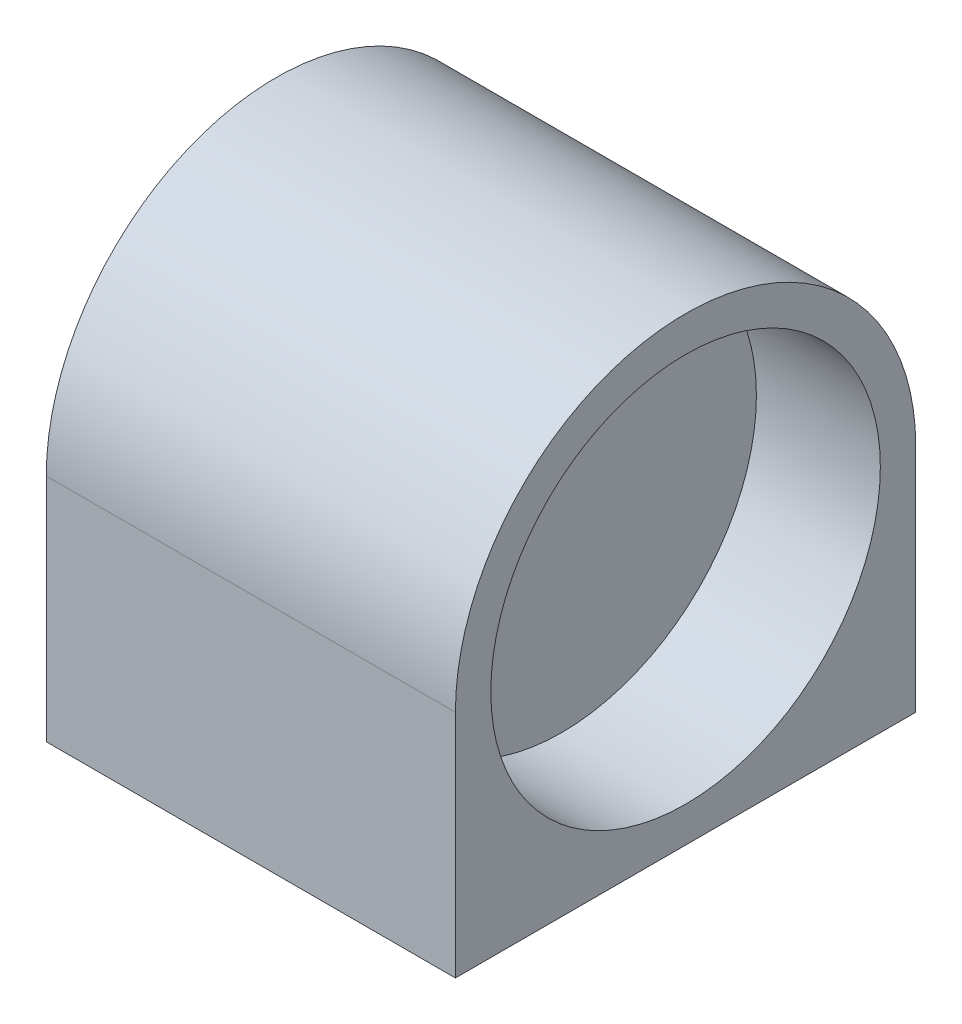
ISO-10303-21;
HEADER;
FILE_DESCRIPTION(('STEP AP214'),'2;1');
FILE_NAME('part.step','',(''),(''),'','','');
FILE_SCHEMA(('AUTOMOTIVE_DESIGN { 1 0 10303 214 1 1 1 1 }'));
ENDSEC;
DATA;
#1=APPLICATION_CONTEXT('core data for automotive mechanical design processes');
#2=APPLICATION_PROTOCOL_DEFINITION('international standard','automotive_design',2000,#1);
#3=PRODUCT_CONTEXT('',#1,'mechanical');
#4=PRODUCT('Part','Part','',(#3));
#5=PRODUCT_RELATED_PRODUCT_CATEGORY('part','',(#4));
#6=PRODUCT_DEFINITION_FORMATION('','',#4);
#7=PRODUCT_DEFINITION_CONTEXT('part definition',#1,'design');
#8=PRODUCT_DEFINITION('design','',#6,#7);
#9=PRODUCT_DEFINITION_SHAPE('','',#8);
#10=(LENGTH_UNIT() NAMED_UNIT(*) SI_UNIT(.MILLI.,.METRE.));
#11=(NAMED_UNIT(*) PLANE_ANGLE_UNIT() SI_UNIT($,.RADIAN.));
#12=(NAMED_UNIT(*) SI_UNIT($,.STERADIAN.) SOLID_ANGLE_UNIT());
#13=UNCERTAINTY_MEASURE_WITH_UNIT(LENGTH_MEASURE(1.E-05),#10,'distance_accuracy_value','');
#14=(GEOMETRIC_REPRESENTATION_CONTEXT(3) GLOBAL_UNCERTAINTY_ASSIGNED_CONTEXT((#13)) GLOBAL_UNIT_ASSIGNED_CONTEXT((#10,
#11,#12)) REPRESENTATION_CONTEXT('',''));
#15=CARTESIAN_POINT('',(0.,0.,0.));
#16=DIRECTION('',(0.,0.,1.));
#17=DIRECTION('',(1.,0.,0.));
#18=AXIS2_PLACEMENT_3D('',#15,#16,#17);
#19=CARTESIAN_POINT('',(-16.11,11.,0.));
#20=DIRECTION('',(-1.,0.,0.));
#21=DIRECTION('',(0.,-1.,0.));
#22=AXIS2_PLACEMENT_3D('',#19,#20,#21);
#23=PLANE('',#22);
#24=CARTESIAN_POINT('',(-16.11,0.,0.));
#25=DIRECTION('',(1.,0.,0.));
#26=DIRECTION('',(0.,1.,0.));
#27=AXIS2_PLACEMENT_3D('',#24,#25,#26);
#28=CIRCLE('',#27,11.);
#29=CARTESIAN_POINT('',(-16.11,11.,0.));
#30=VERTEX_POINT('',#29);
#31=EDGE_CURVE('E18',#30,#30,#28,.F.);
#32=ORIENTED_EDGE('',*,*,#31,.T.);
#33=EDGE_LOOP('',(#32));
#34=FACE_BOUND('',#33,.T.);
#35=ADVANCED_FACE('F15',(#34),#23,.T.);
#36=CARTESIAN_POINT('',(-7.,11.,0.));
#37=DIRECTION('',(1.,0.,0.));
#38=DIRECTION('',(0.,1.,0.));
#39=AXIS2_PLACEMENT_3D('',#36,#37,#38);
#40=PLANE('',#39);
#41=CARTESIAN_POINT('',(-7.,0.,0.));
#42=DIRECTION('',(1.,0.,0.));
#43=DIRECTION('',(0.,1.,0.));
#44=AXIS2_PLACEMENT_3D('',#41,#42,#43);
#45=CIRCLE('',#44,11.);
#46=CARTESIAN_POINT('',(-7.,11.,0.));
#47=VERTEX_POINT('',#46);
#48=EDGE_CURVE('E73',#47,#47,#45,.T.);
#49=ORIENTED_EDGE('',*,*,#48,.T.);
#50=EDGE_LOOP('',(#49));
#51=FACE_BOUND('',#50,.T.);
#52=ADVANCED_FACE('F119',(#51),#40,.T.);
#53=CARTESIAN_POINT('',(-7.,0.,0.));
#54=DIRECTION('',(1.,0.,0.));
#55=DIRECTION('',(0.,1.,0.));
#56=AXIS2_PLACEMENT_3D('',#53,#54,#55);
#57=CYLINDRICAL_SURFACE('',#56,11.);
#58=ORIENTED_EDGE('',*,*,#31,.F.);
#59=EDGE_LOOP('',(#58));
#60=FACE_BOUND('',#59,.T.);
#61=CARTESIAN_POINT('',(-23.11,0.,0.));
#62=DIRECTION('',(1.,0.,0.));
#63=DIRECTION('',(0.,1.,0.));
#64=AXIS2_PLACEMENT_3D('',#61,#62,#63);
#65=CIRCLE('',#64,11.);
#66=CARTESIAN_POINT('',(-23.11,11.,0.));
#67=VERTEX_POINT('',#66);
#68=EDGE_CURVE('E72',#67,#67,#65,.T.);
#69=ORIENTED_EDGE('',*,*,#68,.F.);
#70=EDGE_LOOP('',(#69));
#71=FACE_BOUND('',#70,.T.);
#72=ADVANCED_FACE('F116',(#60,#71),#57,.F.);
#73=CARTESIAN_POINT('',(-7.,0.,0.));
#74=DIRECTION('',(1.,0.,0.));
#75=DIRECTION('',(0.,1.,0.));
#76=AXIS2_PLACEMENT_3D('',#73,#74,#75);
#77=CYLINDRICAL_SURFACE('',#76,13.);
#78=DIRECTION('',(1.,0.,0.));
#79=VECTOR('',#78,1.);
#80=CARTESIAN_POINT('',(18.3847763108502,0.,13.));
#81=LINE('',#80,#79);
#82=CARTESIAN_POINT('',(-23.11,0.,13.));
#83=VERTEX_POINT('',#82);
#84=CARTESIAN_POINT('',(0.,0.,13.));
#85=VERTEX_POINT('',#84);
#86=EDGE_CURVE('E87',#83,#85,#81,.T.);
#87=ORIENTED_EDGE('',*,*,#86,.T.);
#88=CARTESIAN_POINT('',(0.,0.,0.));
#89=DIRECTION('',(1.,0.,0.));
#90=DIRECTION('',(0.,1.,0.));
#91=AXIS2_PLACEMENT_3D('',#88,#89,#90);
#92=CIRCLE('',#91,13.);
#93=CARTESIAN_POINT('',(0.,0.,-13.));
#94=VERTEX_POINT('',#93);
#95=EDGE_CURVE('E68',#94,#85,#92,.T.);
#96=ORIENTED_EDGE('',*,*,#95,.F.);
#97=DIRECTION('',(1.,0.,0.));
#98=VECTOR('',#97,1.);
#99=CARTESIAN_POINT('',(18.3847763108502,0.,-13.));
#100=LINE('',#99,#98);
#101=CARTESIAN_POINT('',(-23.11,0.,-13.));
#102=VERTEX_POINT('',#101);
#103=EDGE_CURVE('E66',#102,#94,#100,.T.);
#104=ORIENTED_EDGE('',*,*,#103,.F.);
#105=CARTESIAN_POINT('',(-23.11,0.,0.));
#106=DIRECTION('',(1.,0.,0.));
#107=DIRECTION('',(0.,1.,0.));
#108=AXIS2_PLACEMENT_3D('',#105,#106,#107);
#109=CIRCLE('',#108,13.);
#110=EDGE_CURVE('E53',#83,#102,#109,.F.);
#111=ORIENTED_EDGE('',*,*,#110,.F.);
#112=EDGE_LOOP('',(#87,#96,#104,#111));
#113=FACE_BOUND('',#112,.T.);
#114=ADVANCED_FACE('F67',(#113),#77,.T.);
#115=CARTESIAN_POINT('',(-7.,0.,0.));
#116=DIRECTION('',(1.,0.,0.));
#117=DIRECTION('',(0.,1.,0.));
#118=AXIS2_PLACEMENT_3D('',#115,#116,#117);
#119=CYLINDRICAL_SURFACE('',#118,11.);
#120=CARTESIAN_POINT('',(0.,0.,0.));
#121=DIRECTION('',(1.,0.,0.));
#122=DIRECTION('',(0.,1.,0.));
#123=AXIS2_PLACEMENT_3D('',#120,#121,#122);
#124=CIRCLE('',#123,11.);
#125=CARTESIAN_POINT('',(0.,11.,0.));
#126=VERTEX_POINT('',#125);
#127=EDGE_CURVE('E98',#126,#126,#124,.F.);
#128=ORIENTED_EDGE('',*,*,#127,.F.);
#129=EDGE_LOOP('',(#128));
#130=FACE_BOUND('',#129,.T.);
#131=ORIENTED_EDGE('',*,*,#48,.F.);
#132=EDGE_LOOP('',(#131));
#133=FACE_BOUND('',#132,.T.);
#134=ADVANCED_FACE('F133',(#130,#133),#119,.F.);
#135=CARTESIAN_POINT('',(18.3847763108502,0.,-13.));
#136=DIRECTION('',(0.,0.,-1.));
#137=DIRECTION('',(0.,1.,0.));
#138=AXIS2_PLACEMENT_3D('',#135,#136,#137);
#139=PLANE('',#138);
#140=DIRECTION('',(-1.,0.,0.));
#141=VECTOR('',#140,1.);
#142=CARTESIAN_POINT('',(18.3847763108502,-13.,-13.));
#143=LINE('',#142,#141);
#144=CARTESIAN_POINT('',(0.,-13.,-13.));
#145=VERTEX_POINT('',#144);
#146=CARTESIAN_POINT('',(-23.11,-13.,-13.));
#147=VERTEX_POINT('',#146);
#148=EDGE_CURVE('E77',#145,#147,#143,.T.);
#149=ORIENTED_EDGE('',*,*,#148,.T.);
#150=DIRECTION('',(0.,-1.,0.));
#151=VECTOR('',#150,1.);
#152=CARTESIAN_POINT('',(-23.11,13.,-13.));
#153=LINE('',#152,#151);
#154=EDGE_CURVE('E61',#102,#147,#153,.T.);
#155=ORIENTED_EDGE('',*,*,#154,.F.);
#156=ORIENTED_EDGE('',*,*,#103,.T.);
#157=DIRECTION('',(0.,1.,0.));
#158=VECTOR('',#157,1.);
#159=CARTESIAN_POINT('',(0.,13.,-13.));
#160=LINE('',#159,#158);
#161=EDGE_CURVE('E88',#145,#94,#160,.T.);
#162=ORIENTED_EDGE('',*,*,#161,.F.);
#163=EDGE_LOOP('',(#149,#155,#156,#162));
#164=FACE_BOUND('',#163,.T.);
#165=ADVANCED_FACE('F76',(#164),#139,.T.);
#166=CARTESIAN_POINT('',(-23.11,13.,0.));
#167=DIRECTION('',(-1.,0.,0.));
#168=DIRECTION('',(0.,-1.,0.));
#169=AXIS2_PLACEMENT_3D('',#166,#167,#168);
#170=PLANE('',#169);
#171=DIRECTION('',(0.,1.,0.));
#172=VECTOR('',#171,1.);
#173=CARTESIAN_POINT('',(-23.11,0.,13.));
#174=LINE('',#173,#172);
#175=CARTESIAN_POINT('',(-23.11,-13.,13.));
#176=VERTEX_POINT('',#175);
#177=EDGE_CURVE('E63',#176,#83,#174,.T.);
#178=ORIENTED_EDGE('',*,*,#177,.T.);
#179=ORIENTED_EDGE('',*,*,#110,.T.);
#180=ORIENTED_EDGE('',*,*,#154,.T.);
#181=DIRECTION('',(0.,0.,1.));
#182=VECTOR('',#181,1.);
#183=CARTESIAN_POINT('',(-23.11,-13.,0.));
#184=LINE('',#183,#182);
#185=EDGE_CURVE('E94',#147,#176,#184,.T.);
#186=ORIENTED_EDGE('',*,*,#185,.T.);
#187=EDGE_LOOP('',(#178,#179,#180,#186));
#188=FACE_BOUND('',#187,.T.);
#189=ORIENTED_EDGE('',*,*,#68,.T.);
#190=EDGE_LOOP('',(#189));
#191=FACE_BOUND('',#190,.T.);
#192=ADVANCED_FACE('F57',(#188,#191),#170,.T.);
#193=CARTESIAN_POINT('',(18.3847763108502,0.,13.));
#194=DIRECTION('',(0.,0.,-1.));
#195=DIRECTION('',(0.,1.,0.));
#196=AXIS2_PLACEMENT_3D('',#193,#194,#195);
#197=PLANE('',#196);
#198=ORIENTED_EDGE('',*,*,#86,.F.);
#199=ORIENTED_EDGE('',*,*,#177,.F.);
#200=DIRECTION('',(-1.,0.,0.));
#201=VECTOR('',#200,1.);
#202=CARTESIAN_POINT('',(18.3847763108502,-13.,13.));
#203=LINE('',#202,#201);
#204=CARTESIAN_POINT('',(0.,-13.,13.));
#205=VERTEX_POINT('',#204);
#206=EDGE_CURVE('E24',#176,#205,#203,.F.);
#207=ORIENTED_EDGE('',*,*,#206,.T.);
#208=DIRECTION('',(0.,1.,0.));
#209=VECTOR('',#208,1.);
#210=CARTESIAN_POINT('',(0.,13.,13.));
#211=LINE('',#210,#209);
#212=EDGE_CURVE('E32',#85,#205,#211,.F.);
#213=ORIENTED_EDGE('',*,*,#212,.F.);
#214=EDGE_LOOP('',(#198,#199,#207,#213));
#215=FACE_BOUND('',#214,.T.);
#216=ADVANCED_FACE('F123',(#215),#197,.F.);
#217=CARTESIAN_POINT('',(0.,13.,0.));
#218=DIRECTION('',(1.,0.,0.));
#219=DIRECTION('',(0.,1.,0.));
#220=AXIS2_PLACEMENT_3D('',#217,#218,#219);
#221=PLANE('',#220);
#222=ORIENTED_EDGE('',*,*,#127,.T.);
#223=EDGE_LOOP('',(#222));
#224=FACE_BOUND('',#223,.T.);
#225=ORIENTED_EDGE('',*,*,#95,.T.);
#226=ORIENTED_EDGE('',*,*,#212,.T.);
#227=DIRECTION('',(0.,0.,1.));
#228=VECTOR('',#227,1.);
#229=CARTESIAN_POINT('',(0.,-13.,0.));
#230=LINE('',#229,#228);
#231=EDGE_CURVE('E10',#205,#145,#230,.F.);
#232=ORIENTED_EDGE('',*,*,#231,.T.);
#233=ORIENTED_EDGE('',*,*,#161,.T.);
#234=EDGE_LOOP('',(#225,#226,#232,#233));
#235=FACE_BOUND('',#234,.T.);
#236=ADVANCED_FACE('F130',(#224,#235),#221,.T.);
#237=CARTESIAN_POINT('',(18.3847763108502,-13.,0.));
#238=DIRECTION('',(0.,1.,0.));
#239=DIRECTION('',(-1.,0.,0.));
#240=AXIS2_PLACEMENT_3D('',#237,#238,#239);
#241=PLANE('',#240);
#242=ORIENTED_EDGE('',*,*,#206,.F.);
#243=ORIENTED_EDGE('',*,*,#185,.F.);
#244=ORIENTED_EDGE('',*,*,#148,.F.);
#245=ORIENTED_EDGE('',*,*,#231,.F.);
#246=EDGE_LOOP('',(#242,#243,#244,#245));
#247=FACE_BOUND('',#246,.T.);
#248=ADVANCED_FACE('F135',(#247),#241,.F.);
#249=CLOSED_SHELL('',(#35,#52,#72,#114,#134,#165,#192,#216,#236,#248));
#250=MANIFOLD_SOLID_BREP('B1',#249);
#251=ADVANCED_BREP_SHAPE_REPRESENTATION('',(#18,#250),#14);
#252=SHAPE_DEFINITION_REPRESENTATION(#9,#251);
ENDSEC;
END-ISO-10303-21;
